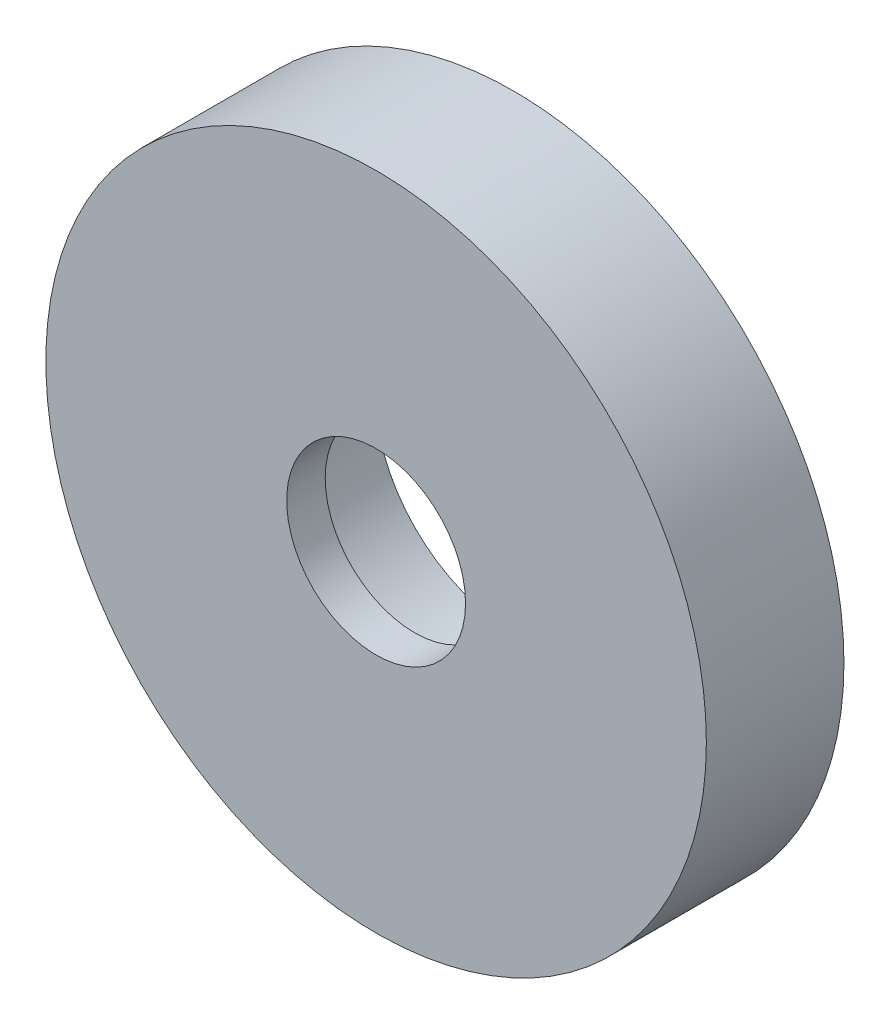
ISO-10303-21;
HEADER;
FILE_DESCRIPTION(('STEP AP214'),'2;1');
FILE_NAME('part.step','',(''),(''),'','','');
FILE_SCHEMA(('AUTOMOTIVE_DESIGN { 1 0 10303 214 1 1 1 1 }'));
ENDSEC;
DATA;
#1=APPLICATION_CONTEXT('core data for automotive mechanical design processes');
#2=APPLICATION_PROTOCOL_DEFINITION('international standard','automotive_design',2000,#1);
#3=PRODUCT_CONTEXT('',#1,'mechanical');
#4=PRODUCT('Part','Part','',(#3));
#5=PRODUCT_RELATED_PRODUCT_CATEGORY('part','',(#4));
#6=PRODUCT_DEFINITION_FORMATION('','',#4);
#7=PRODUCT_DEFINITION_CONTEXT('part definition',#1,'design');
#8=PRODUCT_DEFINITION('design','',#6,#7);
#9=PRODUCT_DEFINITION_SHAPE('','',#8);
#10=(LENGTH_UNIT() NAMED_UNIT(*) SI_UNIT(.MILLI.,.METRE.));
#11=(NAMED_UNIT(*) PLANE_ANGLE_UNIT() SI_UNIT($,.RADIAN.));
#12=(NAMED_UNIT(*) SI_UNIT($,.STERADIAN.) SOLID_ANGLE_UNIT());
#13=UNCERTAINTY_MEASURE_WITH_UNIT(LENGTH_MEASURE(1.E-05),#10,'distance_accuracy_value','');
#14=(GEOMETRIC_REPRESENTATION_CONTEXT(3) GLOBAL_UNCERTAINTY_ASSIGNED_CONTEXT((#13)) GLOBAL_UNIT_ASSIGNED_CONTEXT((#10,
#11,#12)) REPRESENTATION_CONTEXT('',''));
#15=CARTESIAN_POINT('',(0.,0.,0.));
#16=DIRECTION('',(0.,0.,1.));
#17=DIRECTION('',(1.,0.,0.));
#18=AXIS2_PLACEMENT_3D('',#15,#16,#17);
#19=CARTESIAN_POINT('',(95.8640747020422,45.4655790408734,4.7625));
#20=DIRECTION('',(0.,0.,1.));
#21=DIRECTION('',(1.,0.,0.));
#22=AXIS2_PLACEMENT_3D('',#19,#20,#21);
#23=CYLINDRICAL_SURFACE('',#22,5.15873999999999);
#24=CARTESIAN_POINT('',(95.8640747020422,45.4655790408734,4.7625));
#25=DIRECTION('',(0.,0.,1.));
#26=DIRECTION('',(1.,0.,0.));
#27=AXIS2_PLACEMENT_3D('',#24,#25,#26);
#28=CIRCLE('',#27,5.15873999999999);
#29=CARTESIAN_POINT('',(101.022814702042,45.4655790408734,4.7625));
#30=VERTEX_POINT('',#29);
#31=EDGE_CURVE('E47',#30,#30,#28,.T.);
#32=ORIENTED_EDGE('',*,*,#31,.T.);
#33=EDGE_LOOP('',(#32));
#34=FACE_BOUND('',#33,.T.);
#35=CARTESIAN_POINT('',(95.8640747020422,45.4655790408734,2.54));
#36=DIRECTION('',(0.,0.,-1.));
#37=DIRECTION('',(-1.,0.,0.));
#38=AXIS2_PLACEMENT_3D('',#35,#36,#37);
#39=CIRCLE('',#38,5.15873999999999);
#40=CARTESIAN_POINT('',(90.7053347020422,45.4655790408734,2.54));
#41=VERTEX_POINT('',#40);
#42=EDGE_CURVE('E34',#41,#41,#39,.F.);
#43=ORIENTED_EDGE('',*,*,#42,.F.);
#44=EDGE_LOOP('',(#43));
#45=FACE_BOUND('',#44,.T.);
#46=ADVANCED_FACE('F30',(#34,#45),#23,.F.);
#47=CARTESIAN_POINT('',(95.8640747020422,45.4655790408734,-3.175));
#48=DIRECTION('',(0.,0.,1.));
#49=DIRECTION('',(1.,0.,0.));
#50=AXIS2_PLACEMENT_3D('',#47,#48,#49);
#51=CYLINDRICAL_SURFACE('',#50,19.05);
#52=CARTESIAN_POINT('',(95.8640747020422,45.4655790408734,-3.175));
#53=DIRECTION('',(0.,0.,1.));
#54=DIRECTION('',(1.,0.,0.));
#55=AXIS2_PLACEMENT_3D('',#52,#53,#54);
#56=CIRCLE('',#55,19.05);
#57=CARTESIAN_POINT('',(114.914074702042,45.4655790408734,-3.175));
#58=VERTEX_POINT('',#57);
#59=EDGE_CURVE('E10',#58,#58,#56,.T.);
#60=ORIENTED_EDGE('',*,*,#59,.T.);
#61=EDGE_LOOP('',(#60));
#62=FACE_BOUND('',#61,.T.);
#63=CARTESIAN_POINT('',(95.8640747020422,45.4655790408734,4.7625));
#64=DIRECTION('',(0.,0.,1.));
#65=DIRECTION('',(1.,0.,0.));
#66=AXIS2_PLACEMENT_3D('',#63,#64,#65);
#67=CIRCLE('',#66,19.05);
#68=CARTESIAN_POINT('',(114.914074702042,45.4655790408734,4.7625));
#69=VERTEX_POINT('',#68);
#70=EDGE_CURVE('E42',#69,#69,#67,.T.);
#71=ORIENTED_EDGE('',*,*,#70,.F.);
#72=EDGE_LOOP('',(#71));
#73=FACE_BOUND('',#72,.T.);
#74=ADVANCED_FACE('F32',(#62,#73),#51,.T.);
#75=CARTESIAN_POINT('',(95.8640747020422,45.4655790408734,-3.175));
#76=DIRECTION('',(0.,0.,1.));
#77=DIRECTION('',(1.,0.,0.));
#78=AXIS2_PLACEMENT_3D('',#75,#76,#77);
#79=PLANE('',#78);
#80=CARTESIAN_POINT('',(95.8640747020422,45.4655790408734,-3.175));
#81=DIRECTION('',(0.,0.,1.));
#82=DIRECTION('',(1.,0.,0.));
#83=AXIS2_PLACEMENT_3D('',#80,#81,#82);
#84=CIRCLE('',#83,8.00099999999999);
#85=CARTESIAN_POINT('',(103.865074702042,45.4655790408734,-3.175));
#86=VERTEX_POINT('',#85);
#87=EDGE_CURVE('E38',#86,#86,#84,.T.);
#88=ORIENTED_EDGE('',*,*,#87,.T.);
#89=EDGE_LOOP('',(#88));
#90=FACE_BOUND('',#89,.T.);
#91=ORIENTED_EDGE('',*,*,#59,.F.);
#92=EDGE_LOOP('',(#91));
#93=FACE_BOUND('',#92,.T.);
#94=ADVANCED_FACE('F65',(#90,#93),#79,.F.);
#95=CARTESIAN_POINT('',(95.8640747020422,45.4655790408734,-3.175));
#96=DIRECTION('',(0.,0.,1.));
#97=DIRECTION('',(1.,0.,0.));
#98=AXIS2_PLACEMENT_3D('',#95,#96,#97);
#99=CYLINDRICAL_SURFACE('',#98,8.00099999999999);
#100=ORIENTED_EDGE('',*,*,#87,.F.);
#101=EDGE_LOOP('',(#100));
#102=FACE_BOUND('',#101,.T.);
#103=CARTESIAN_POINT('',(95.8640747020422,45.4655790408734,2.54));
#104=DIRECTION('',(0.,0.,-1.));
#105=DIRECTION('',(-1.,0.,0.));
#106=AXIS2_PLACEMENT_3D('',#103,#104,#105);
#107=CIRCLE('',#106,8.00099999999999);
#108=CARTESIAN_POINT('',(87.8630747020422,45.4655790408734,2.54));
#109=VERTEX_POINT('',#108);
#110=EDGE_CURVE('E50',#109,#109,#107,.T.);
#111=ORIENTED_EDGE('',*,*,#110,.F.);
#112=EDGE_LOOP('',(#111));
#113=FACE_BOUND('',#112,.T.);
#114=ADVANCED_FACE('F71',(#102,#113),#99,.F.);
#115=CARTESIAN_POINT('',(95.8640747020422,45.4655790408734,4.7625));
#116=DIRECTION('',(0.,0.,1.));
#117=DIRECTION('',(1.,0.,0.));
#118=AXIS2_PLACEMENT_3D('',#115,#116,#117);
#119=PLANE('',#118);
#120=ORIENTED_EDGE('',*,*,#31,.F.);
#121=EDGE_LOOP('',(#120));
#122=FACE_BOUND('',#121,.T.);
#123=ORIENTED_EDGE('',*,*,#70,.T.);
#124=EDGE_LOOP('',(#123));
#125=FACE_BOUND('',#124,.T.);
#126=ADVANCED_FACE('F68',(#122,#125),#119,.T.);
#127=CARTESIAN_POINT('',(95.8640747020422,45.4655790408734,2.54));
#128=DIRECTION('',(0.,0.,-1.));
#129=DIRECTION('',(-1.,0.,0.));
#130=AXIS2_PLACEMENT_3D('',#127,#128,#129);
#131=PLANE('',#130);
#132=ORIENTED_EDGE('',*,*,#110,.T.);
#133=EDGE_LOOP('',(#132));
#134=FACE_BOUND('',#133,.T.);
#135=ORIENTED_EDGE('',*,*,#42,.T.);
#136=EDGE_LOOP('',(#135));
#137=FACE_BOUND('',#136,.T.);
#138=ADVANCED_FACE('F57',(#134,#137),#131,.T.);
#139=CLOSED_SHELL('',(#46,#74,#94,#114,#126,#138));
#140=MANIFOLD_SOLID_BREP('B2',#139);
#141=ADVANCED_BREP_SHAPE_REPRESENTATION('',(#18,#140),#14);
#142=SHAPE_DEFINITION_REPRESENTATION(#9,#141);
ENDSEC;
END-ISO-10303-21;
